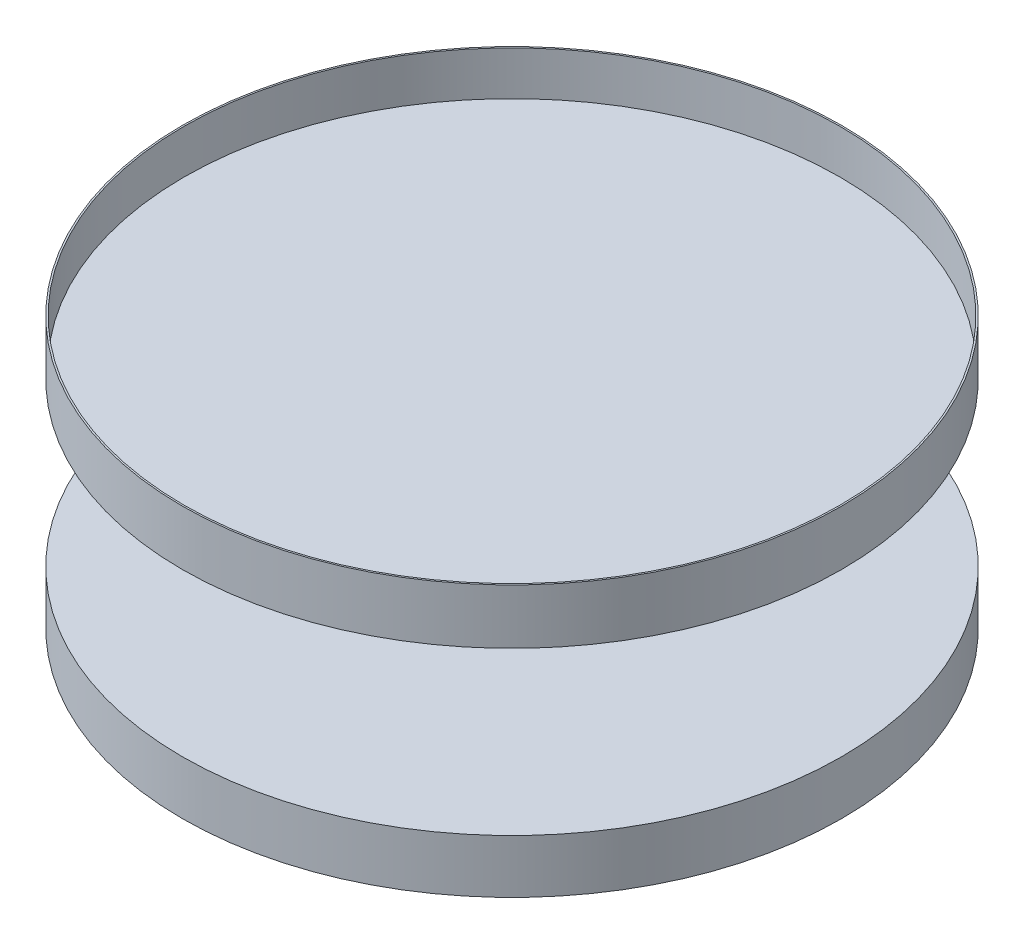
ISO-10303-21;
HEADER;
FILE_DESCRIPTION(('STEP AP214'),'2;1');
FILE_NAME('part.step','',(''),(''),'','','');
FILE_SCHEMA(('AUTOMOTIVE_DESIGN { 1 0 10303 214 1 1 1 1 }'));
ENDSEC;
DATA;
#1=APPLICATION_CONTEXT('core data for automotive mechanical design processes');
#2=APPLICATION_PROTOCOL_DEFINITION('international standard','automotive_design',2000,#1);
#3=PRODUCT_CONTEXT('',#1,'mechanical');
#4=PRODUCT('Part','Part','',(#3));
#5=PRODUCT_RELATED_PRODUCT_CATEGORY('part','',(#4));
#6=PRODUCT_DEFINITION_FORMATION('','',#4);
#7=PRODUCT_DEFINITION_CONTEXT('part definition',#1,'design');
#8=PRODUCT_DEFINITION('design','',#6,#7);
#9=PRODUCT_DEFINITION_SHAPE('','',#8);
#10=(LENGTH_UNIT() NAMED_UNIT(*) SI_UNIT(.MILLI.,.METRE.));
#11=(NAMED_UNIT(*) PLANE_ANGLE_UNIT() SI_UNIT($,.RADIAN.));
#12=(NAMED_UNIT(*) SI_UNIT($,.STERADIAN.) SOLID_ANGLE_UNIT());
#13=UNCERTAINTY_MEASURE_WITH_UNIT(LENGTH_MEASURE(1.E-05),#10,'distance_accuracy_value','');
#14=(GEOMETRIC_REPRESENTATION_CONTEXT(3) GLOBAL_UNCERTAINTY_ASSIGNED_CONTEXT((#13)) GLOBAL_UNIT_ASSIGNED_CONTEXT((#10,
#11,#12)) REPRESENTATION_CONTEXT('',''));
#15=CARTESIAN_POINT('',(0.,0.,0.));
#16=DIRECTION('',(0.,0.,1.));
#17=DIRECTION('',(1.,0.,0.));
#18=AXIS2_PLACEMENT_3D('',#15,#16,#17);
#19=CARTESIAN_POINT('',(0.,-99.6197920465217,0.));
#20=DIRECTION('',(0.,-1.,0.));
#21=DIRECTION('',(0.,0.,-1.));
#22=AXIS2_PLACEMENT_3D('',#19,#20,#21);
#23=PLANE('',#22);
#24=CARTESIAN_POINT('',(0.,-99.6197920465217,0.));
#25=DIRECTION('',(0.,-1.,0.));
#26=DIRECTION('',(0.,0.,-1.));
#27=AXIS2_PLACEMENT_3D('',#24,#25,#26);
#28=CIRCLE('',#27,645.624954417398);
#29=CARTESIAN_POINT('',(0.,-99.6197920465217,-645.624954417398));
#30=VERTEX_POINT('',#29);
#31=EDGE_CURVE('E10',#30,#30,#28,.T.);
#32=ORIENTED_EDGE('',*,*,#31,.T.);
#33=EDGE_LOOP('',(#32));
#34=FACE_BOUND('',#33,.T.);
#35=ADVANCED_FACE('F30',(#34),#23,.T.);
#36=CARTESIAN_POINT('',(0.,-99.6197920465217,0.));
#37=DIRECTION('',(0.,-1.,0.));
#38=DIRECTION('',(0.,0.,-1.));
#39=AXIS2_PLACEMENT_3D('',#36,#37,#38);
#40=CYLINDRICAL_SURFACE('',#39,645.624954417398);
#41=CARTESIAN_POINT('',(0.,5.38020795347832,0.));
#42=DIRECTION('',(0.,-1.,0.));
#43=DIRECTION('',(0.,0.,-1.));
#44=AXIS2_PLACEMENT_3D('',#41,#42,#43);
#45=CIRCLE('',#44,645.624954417398);
#46=CARTESIAN_POINT('',(0.,5.38020795347832,-645.624954417398));
#47=VERTEX_POINT('',#46);
#48=EDGE_CURVE('E36',#47,#47,#45,.T.);
#49=ORIENTED_EDGE('',*,*,#48,.T.);
#50=EDGE_LOOP('',(#49));
#51=FACE_BOUND('',#50,.T.);
#52=ORIENTED_EDGE('',*,*,#31,.F.);
#53=EDGE_LOOP('',(#52));
#54=FACE_BOUND('',#53,.T.);
#55=ADVANCED_FACE('F74',(#51,#54),#40,.T.);
#56=CARTESIAN_POINT('',(645.624954417398,5.38020795347832,0.));
#57=DIRECTION('',(0.,1.,0.));
#58=DIRECTION('',(0.,0.,1.));
#59=AXIS2_PLACEMENT_3D('',#56,#57,#58);
#60=PLANE('',#59);
#61=CARTESIAN_POINT('',(0.,5.38020795347832,0.));
#62=DIRECTION('',(0.,-1.,0.));
#63=DIRECTION('',(0.,0.,-1.));
#64=AXIS2_PLACEMENT_3D('',#61,#62,#63);
#65=CIRCLE('',#64,16.140623860435);
#66=CARTESIAN_POINT('',(0.,5.38020795347832,-16.140623860435));
#67=VERTEX_POINT('',#66);
#68=EDGE_CURVE('E40',#67,#67,#65,.T.);
#69=ORIENTED_EDGE('',*,*,#68,.T.);
#70=EDGE_LOOP('',(#69));
#71=FACE_BOUND('',#70,.T.);
#72=ORIENTED_EDGE('',*,*,#48,.F.);
#73=EDGE_LOOP('',(#72));
#74=FACE_BOUND('',#73,.T.);
#75=ADVANCED_FACE('F78',(#71,#74),#60,.T.);
#76=CARTESIAN_POINT('',(0.,-99.6197920465217,0.));
#77=DIRECTION('',(0.,-1.,0.));
#78=DIRECTION('',(0.,0.,-1.));
#79=AXIS2_PLACEMENT_3D('',#76,#77,#78);
#80=CYLINDRICAL_SURFACE('',#79,16.140623860435);
#81=CARTESIAN_POINT('',(0.,322.812477208699,0.));
#82=DIRECTION('',(0.,-1.,0.));
#83=DIRECTION('',(0.,0.,-1.));
#84=AXIS2_PLACEMENT_3D('',#81,#82,#83);
#85=CIRCLE('',#84,16.140623860435);
#86=CARTESIAN_POINT('',(0.,322.812477208699,-16.140623860435));
#87=VERTEX_POINT('',#86);
#88=EDGE_CURVE('E44',#87,#87,#85,.T.);
#89=ORIENTED_EDGE('',*,*,#88,.T.);
#90=EDGE_LOOP('',(#89));
#91=FACE_BOUND('',#90,.T.);
#92=ORIENTED_EDGE('',*,*,#68,.F.);
#93=EDGE_LOOP('',(#92));
#94=FACE_BOUND('',#93,.T.);
#95=ADVANCED_FACE('F82',(#91,#94),#80,.T.);
#96=CARTESIAN_POINT('',(16.140623860435,322.812477208699,0.));
#97=DIRECTION('',(0.,-1.,0.));
#98=DIRECTION('',(0.,0.,-1.));
#99=AXIS2_PLACEMENT_3D('',#96,#97,#98);
#100=PLANE('',#99);
#101=CARTESIAN_POINT('',(0.,322.812477208699,0.));
#102=DIRECTION('',(0.,-1.,0.));
#103=DIRECTION('',(0.,0.,-1.));
#104=AXIS2_PLACEMENT_3D('',#101,#102,#103);
#105=CIRCLE('',#104,645.624954417398);
#106=CARTESIAN_POINT('',(0.,322.812477208699,-645.624954417398));
#107=VERTEX_POINT('',#106);
#108=EDGE_CURVE('E49',#107,#107,#105,.T.);
#109=ORIENTED_EDGE('',*,*,#108,.T.);
#110=EDGE_LOOP('',(#109));
#111=FACE_BOUND('',#110,.T.);
#112=ORIENTED_EDGE('',*,*,#88,.F.);
#113=EDGE_LOOP('',(#112));
#114=FACE_BOUND('',#113,.T.);
#115=ADVANCED_FACE('F89',(#111,#114),#100,.T.);
#116=CARTESIAN_POINT('',(0.,-99.6197920465217,0.));
#117=DIRECTION('',(0.,-1.,0.));
#118=DIRECTION('',(0.,0.,-1.));
#119=AXIS2_PLACEMENT_3D('',#116,#117,#118);
#120=CYLINDRICAL_SURFACE('',#119,645.624954417398);
#121=CARTESIAN_POINT('',(0.,430.416636278266,0.));
#122=DIRECTION('',(0.,-1.,0.));
#123=DIRECTION('',(0.,0.,-1.));
#124=AXIS2_PLACEMENT_3D('',#121,#122,#123);
#125=CIRCLE('',#124,645.624954417398);
#126=CARTESIAN_POINT('',(0.,430.416636278266,-645.624954417398));
#127=VERTEX_POINT('',#126);
#128=EDGE_CURVE('E52',#127,#127,#125,.T.);
#129=ORIENTED_EDGE('',*,*,#128,.T.);
#130=EDGE_LOOP('',(#129));
#131=FACE_BOUND('',#130,.T.);
#132=ORIENTED_EDGE('',*,*,#108,.F.);
#133=EDGE_LOOP('',(#132));
#134=FACE_BOUND('',#133,.T.);
#135=ADVANCED_FACE('F93',(#131,#134),#120,.T.);
#136=CARTESIAN_POINT('',(645.624954417398,430.416636278266,0.));
#137=DIRECTION('',(0.,1.,0.));
#138=DIRECTION('',(0.,0.,1.));
#139=AXIS2_PLACEMENT_3D('',#136,#137,#138);
#140=PLANE('',#139);
#141=CARTESIAN_POINT('',(0.,430.416636278266,0.));
#142=DIRECTION('',(0.,-1.,0.));
#143=DIRECTION('',(0.,0.,-1.));
#144=AXIS2_PLACEMENT_3D('',#141,#142,#143);
#145=CIRCLE('',#144,642.396829645311);
#146=CARTESIAN_POINT('',(0.,430.416636278266,-642.396829645311));
#147=VERTEX_POINT('',#146);
#148=EDGE_CURVE('E55',#147,#147,#145,.T.);
#149=ORIENTED_EDGE('',*,*,#148,.T.);
#150=EDGE_LOOP('',(#149));
#151=FACE_BOUND('',#150,.T.);
#152=ORIENTED_EDGE('',*,*,#128,.F.);
#153=EDGE_LOOP('',(#152));
#154=FACE_BOUND('',#153,.T.);
#155=ADVANCED_FACE('F71',(#151,#154),#140,.T.);
#156=CARTESIAN_POINT('',(0.,-99.6197920465217,0.));
#157=DIRECTION('',(0.,-1.,0.));
#158=DIRECTION('',(0.,0.,-1.));
#159=AXIS2_PLACEMENT_3D('',#156,#157,#158);
#160=CYLINDRICAL_SURFACE('',#159,642.396829645311);
#161=CARTESIAN_POINT('',(0.,344.333309022613,0.));
#162=DIRECTION('',(0.,-1.,0.));
#163=DIRECTION('',(0.,0.,-1.));
#164=AXIS2_PLACEMENT_3D('',#161,#162,#163);
#165=CIRCLE('',#164,642.396829645311);
#166=CARTESIAN_POINT('',(0.,344.333309022613,-642.396829645311));
#167=VERTEX_POINT('',#166);
#168=EDGE_CURVE('E58',#167,#167,#165,.T.);
#169=ORIENTED_EDGE('',*,*,#168,.T.);
#170=EDGE_LOOP('',(#169));
#171=FACE_BOUND('',#170,.T.);
#172=ORIENTED_EDGE('',*,*,#148,.F.);
#173=EDGE_LOOP('',(#172));
#174=FACE_BOUND('',#173,.T.);
#175=ADVANCED_FACE('F62',(#171,#174),#160,.F.);
#176=CARTESIAN_POINT('',(642.396829645311,344.333309022612,0.));
#177=DIRECTION('',(0.,1.,0.));
#178=DIRECTION('',(0.,0.,1.));
#179=AXIS2_PLACEMENT_3D('',#176,#177,#178);
#180=PLANE('',#179);
#181=ORIENTED_EDGE('',*,*,#168,.F.);
#182=EDGE_LOOP('',(#181));
#183=FACE_BOUND('',#182,.T.);
#184=ADVANCED_FACE('F65',(#183),#180,.T.);
#185=CLOSED_SHELL('',(#35,#55,#75,#95,#115,#135,#155,#175,#184));
#186=MANIFOLD_SOLID_BREP('B2',#185);
#187=ADVANCED_BREP_SHAPE_REPRESENTATION('',(#18,#186),#14);
#188=SHAPE_DEFINITION_REPRESENTATION(#9,#187);
ENDSEC;
END-ISO-10303-21;
